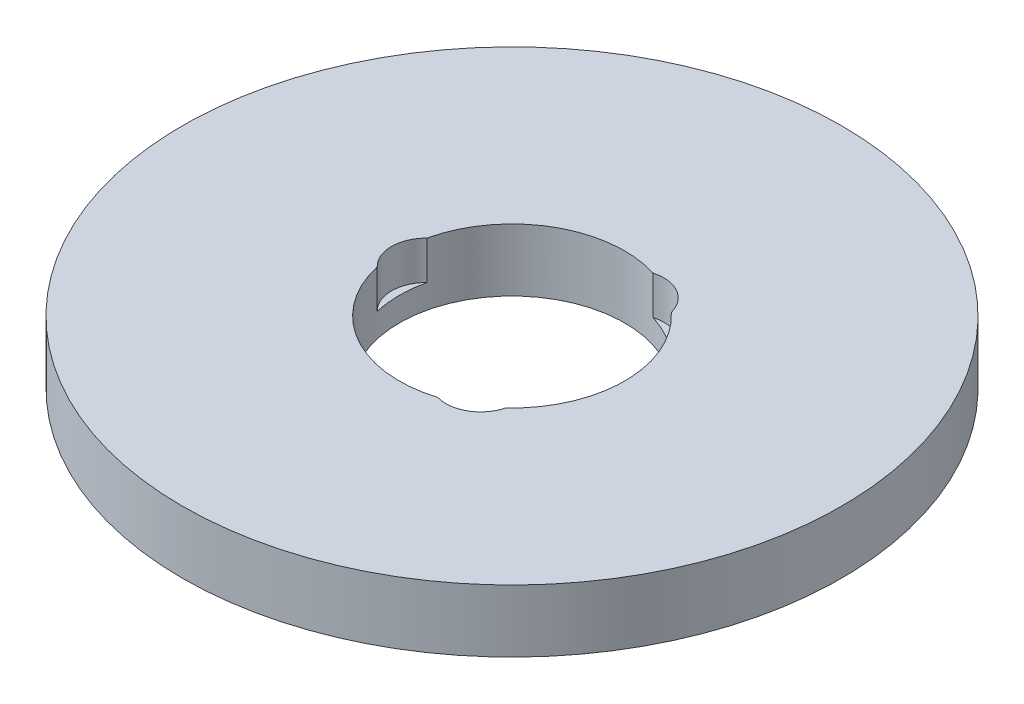
ISO-10303-21;
HEADER;
FILE_DESCRIPTION(('STEP AP214'),'2;1');
FILE_NAME('part.step','',(''),(''),'','','');
FILE_SCHEMA(('AUTOMOTIVE_DESIGN { 1 0 10303 214 1 1 1 1 }'));
ENDSEC;
DATA;
#1=APPLICATION_CONTEXT('core data for automotive mechanical design processes');
#2=APPLICATION_PROTOCOL_DEFINITION('international standard','automotive_design',2000,#1);
#3=PRODUCT_CONTEXT('',#1,'mechanical');
#4=PRODUCT('Part','Part','',(#3));
#5=PRODUCT_RELATED_PRODUCT_CATEGORY('part','',(#4));
#6=PRODUCT_DEFINITION_FORMATION('','',#4);
#7=PRODUCT_DEFINITION_CONTEXT('part definition',#1,'design');
#8=PRODUCT_DEFINITION('design','',#6,#7);
#9=PRODUCT_DEFINITION_SHAPE('','',#8);
#10=(LENGTH_UNIT() NAMED_UNIT(*) SI_UNIT(.MILLI.,.METRE.));
#11=(NAMED_UNIT(*) PLANE_ANGLE_UNIT() SI_UNIT($,.RADIAN.));
#12=(NAMED_UNIT(*) SI_UNIT($,.STERADIAN.) SOLID_ANGLE_UNIT());
#13=UNCERTAINTY_MEASURE_WITH_UNIT(LENGTH_MEASURE(1.E-05),#10,'distance_accuracy_value','');
#14=(GEOMETRIC_REPRESENTATION_CONTEXT(3) GLOBAL_UNCERTAINTY_ASSIGNED_CONTEXT((#13)) GLOBAL_UNIT_ASSIGNED_CONTEXT((#10,
#11,#12)) REPRESENTATION_CONTEXT('',''));
#15=CARTESIAN_POINT('',(0.,0.,0.));
#16=DIRECTION('',(0.,0.,1.));
#17=DIRECTION('',(1.,0.,0.));
#18=AXIS2_PLACEMENT_3D('',#15,#16,#17);
#19=CARTESIAN_POINT('',(0.,18.,0.));
#20=DIRECTION('',(0.,-1.,0.));
#21=DIRECTION('',(0.,0.,-1.));
#22=AXIS2_PLACEMENT_3D('',#19,#20,#21);
#23=CYLINDRICAL_SURFACE('',#22,95.);
#24=CARTESIAN_POINT('',(0.,18.,0.));
#25=DIRECTION('',(0.,1.,0.));
#26=DIRECTION('',(0.,0.,1.));
#27=AXIS2_PLACEMENT_3D('',#24,#25,#26);
#28=CIRCLE('',#27,95.);
#29=CARTESIAN_POINT('',(0.,18.,95.));
#30=VERTEX_POINT('',#29);
#31=EDGE_CURVE('E130',#30,#30,#28,.T.);
#32=ORIENTED_EDGE('',*,*,#31,.F.);
#33=EDGE_LOOP('',(#32));
#34=FACE_BOUND('',#33,.T.);
#35=CARTESIAN_POINT('',(0.,0.,0.));
#36=DIRECTION('',(0.,1.,0.));
#37=DIRECTION('',(0.,0.,1.));
#38=AXIS2_PLACEMENT_3D('',#35,#36,#37);
#39=CIRCLE('',#38,95.);
#40=CARTESIAN_POINT('',(0.,0.,95.));
#41=VERTEX_POINT('',#40);
#42=EDGE_CURVE('E117',#41,#41,#39,.T.);
#43=ORIENTED_EDGE('',*,*,#42,.T.);
#44=EDGE_LOOP('',(#43));
#45=FACE_BOUND('',#44,.T.);
#46=ADVANCED_FACE('F39',(#34,#45),#23,.T.);
#47=CARTESIAN_POINT('',(0.,18.,0.));
#48=DIRECTION('',(0.,1.,0.));
#49=DIRECTION('',(0.,0.,1.));
#50=AXIS2_PLACEMENT_3D('',#47,#48,#49);
#51=PLANE('',#50);
#52=CARTESIAN_POINT('',(12.3629652140103,18.,21.4132838828722));
#53=DIRECTION('',(0.,1.,0.));
#54=DIRECTION('',(0.866025403784436,0.,-0.500000000000004));
#55=AXIS2_PLACEMENT_3D('',#52,#53,#54);
#56=CIRCLE('',#55,10.);
#57=CARTESIAN_POINT('',(9.64334562870771,18.,31.0363639153378));
#58=VERTEX_POINT('',#57);
#59=CARTESIAN_POINT('',(22.0566067774276,18.,23.8695642496032));
#60=VERTEX_POINT('',#59);
#61=EDGE_CURVE('E148',#58,#60,#56,.T.);
#62=ORIENTED_EDGE('',*,*,#61,.F.);
#63=CARTESIAN_POINT('',(0.,18.,0.));
#64=DIRECTION('',(0.,1.,0.));
#65=DIRECTION('',(0.,0.,1.));
#66=AXIS2_PLACEMENT_3D('',#63,#64,#65);
#67=CIRCLE('',#66,32.5);
#68=CARTESIAN_POINT('',(-31.699952406135,18.,7.16679966573456));
#69=VERTEX_POINT('',#68);
#70=EDGE_CURVE('E113',#69,#58,#67,.T.);
#71=ORIENTED_EDGE('',*,*,#70,.F.);
#72=CARTESIAN_POINT('',(-24.7259304280203,18.,0.));
#73=DIRECTION('',(0.,1.,0.));
#74=DIRECTION('',(0.,0.,1.));
#75=AXIS2_PLACEMENT_3D('',#72,#73,#74);
#76=CIRCLE('',#75,10.);
#77=CARTESIAN_POINT('',(-31.699952406135,18.,-7.16679966573456));
#78=VERTEX_POINT('',#77);
#79=EDGE_CURVE('E125',#78,#69,#76,.T.);
#80=ORIENTED_EDGE('',*,*,#79,.F.);
#81=CARTESIAN_POINT('',(9.64334562870728,18.,-31.036363915338));
#82=VERTEX_POINT('',#81);
#83=EDGE_CURVE('E107',#82,#78,#67,.T.);
#84=ORIENTED_EDGE('',*,*,#83,.F.);
#85=CARTESIAN_POINT('',(12.36296521401,18.,-21.4132838828724));
#86=DIRECTION('',(0.,1.,0.));
#87=DIRECTION('',(-0.866025403784443,0.,-0.499999999999992));
#88=AXIS2_PLACEMENT_3D('',#85,#86,#87);
#89=CIRCLE('',#88,10.);
#90=CARTESIAN_POINT('',(22.0566067774273,18.,-23.8695642496035));
#91=VERTEX_POINT('',#90);
#92=EDGE_CURVE('E95',#91,#82,#89,.T.);
#93=ORIENTED_EDGE('',*,*,#92,.F.);
#94=EDGE_CURVE('E106',#60,#91,#67,.T.);
#95=ORIENTED_EDGE('',*,*,#94,.F.);
#96=EDGE_LOOP('',(#62,#71,#80,#84,#93,#95));
#97=FACE_BOUND('',#96,.T.);
#98=ORIENTED_EDGE('',*,*,#31,.T.);
#99=EDGE_LOOP('',(#98));
#100=FACE_BOUND('',#99,.T.);
#101=ADVANCED_FACE('F102',(#97,#100),#51,.T.);
#102=CARTESIAN_POINT('',(0.,0.,0.));
#103=DIRECTION('',(0.,1.,0.));
#104=DIRECTION('',(0.,0.,1.));
#105=AXIS2_PLACEMENT_3D('',#102,#103,#104);
#106=PLANE('',#105);
#107=CARTESIAN_POINT('',(0.,0.,0.));
#108=DIRECTION('',(0.,1.,0.));
#109=DIRECTION('',(0.,0.,1.));
#110=AXIS2_PLACEMENT_3D('',#107,#108,#109);
#111=CIRCLE('',#110,32.5);
#112=CARTESIAN_POINT('',(0.,0.,32.5));
#113=VERTEX_POINT('',#112);
#114=EDGE_CURVE('E118',#113,#113,#111,.T.);
#115=ORIENTED_EDGE('',*,*,#114,.T.);
#116=EDGE_LOOP('',(#115));
#117=FACE_BOUND('',#116,.T.);
#118=ORIENTED_EDGE('',*,*,#42,.F.);
#119=EDGE_LOOP('',(#118));
#120=FACE_BOUND('',#119,.T.);
#121=ADVANCED_FACE('F161',(#117,#120),#106,.F.);
#122=CARTESIAN_POINT('',(0.,18.,0.));
#123=DIRECTION('',(0.,-1.,0.));
#124=DIRECTION('',(0.,0.,-1.));
#125=AXIS2_PLACEMENT_3D('',#122,#123,#124);
#126=CYLINDRICAL_SURFACE('',#125,32.5);
#127=DIRECTION('',(0.,1.,0.));
#128=VECTOR('',#127,1.);
#129=CARTESIAN_POINT('',(9.64334562870771,12.4525637605796,31.0363639153378));
#130=LINE('',#129,#128);
#131=CARTESIAN_POINT('',(9.64334562870771,6.90512752115929,31.0363639153378));
#132=VERTEX_POINT('',#131);
#133=EDGE_CURVE('E11',#132,#58,#130,.T.);
#134=ORIENTED_EDGE('',*,*,#133,.F.);
#135=CARTESIAN_POINT('',(0.,6.90512752115929,0.));
#136=DIRECTION('',(0.,1.,0.));
#137=DIRECTION('',(0.,0.,1.));
#138=AXIS2_PLACEMENT_3D('',#135,#136,#137);
#139=CIRCLE('',#138,32.5);
#140=CARTESIAN_POINT('',(22.0566067774276,6.90512752115929,23.8695642496032));
#141=VERTEX_POINT('',#140);
#142=EDGE_CURVE('E100',#132,#141,#139,.T.);
#143=ORIENTED_EDGE('',*,*,#142,.T.);
#144=DIRECTION('',(0.,1.,0.));
#145=VECTOR('',#144,1.);
#146=CARTESIAN_POINT('',(22.0566067774276,12.4525637605796,23.8695642496032));
#147=LINE('',#146,#145);
#148=EDGE_CURVE('E46',#60,#141,#147,.F.);
#149=ORIENTED_EDGE('',*,*,#148,.F.);
#150=ORIENTED_EDGE('',*,*,#94,.T.);
#151=DIRECTION('',(0.,1.,0.));
#152=VECTOR('',#151,1.);
#153=CARTESIAN_POINT('',(22.0566067774273,12.4525637605796,-23.8695642496035));
#154=LINE('',#153,#152);
#155=CARTESIAN_POINT('',(22.0566067774273,6.90512752115929,-23.8695642496035));
#156=VERTEX_POINT('',#155);
#157=EDGE_CURVE('E90',#156,#91,#154,.T.);
#158=ORIENTED_EDGE('',*,*,#157,.F.);
#159=CARTESIAN_POINT('',(0.,6.90512752115929,0.));
#160=DIRECTION('',(0.,1.,0.));
#161=DIRECTION('',(0.,0.,1.));
#162=AXIS2_PLACEMENT_3D('',#159,#160,#161);
#163=CIRCLE('',#162,32.5);
#164=CARTESIAN_POINT('',(9.64334562870728,6.90512752115929,-31.036363915338));
#165=VERTEX_POINT('',#164);
#166=EDGE_CURVE('E143',#156,#165,#163,.T.);
#167=ORIENTED_EDGE('',*,*,#166,.T.);
#168=DIRECTION('',(0.,1.,0.));
#169=VECTOR('',#168,1.);
#170=CARTESIAN_POINT('',(9.64334562870727,12.4525637605796,-31.036363915338));
#171=LINE('',#170,#169);
#172=EDGE_CURVE('E98',#82,#165,#171,.F.);
#173=ORIENTED_EDGE('',*,*,#172,.F.);
#174=ORIENTED_EDGE('',*,*,#83,.T.);
#175=DIRECTION('',(0.,1.,0.));
#176=VECTOR('',#175,1.);
#177=CARTESIAN_POINT('',(-31.699952406135,12.4525637605796,-7.16679966573456));
#178=LINE('',#177,#176);
#179=CARTESIAN_POINT('',(-31.699952406135,6.90512752115929,-7.16679966573456));
#180=VERTEX_POINT('',#179);
#181=EDGE_CURVE('E137',#180,#78,#178,.T.);
#182=ORIENTED_EDGE('',*,*,#181,.F.);
#183=CARTESIAN_POINT('',(0.,6.90512752115929,0.));
#184=DIRECTION('',(0.,1.,0.));
#185=DIRECTION('',(0.,0.,1.));
#186=AXIS2_PLACEMENT_3D('',#183,#184,#185);
#187=CIRCLE('',#186,32.5);
#188=CARTESIAN_POINT('',(-31.699952406135,6.90512752115929,7.16679966573456));
#189=VERTEX_POINT('',#188);
#190=EDGE_CURVE('E128',#180,#189,#187,.T.);
#191=ORIENTED_EDGE('',*,*,#190,.T.);
#192=DIRECTION('',(0.,1.,0.));
#193=VECTOR('',#192,1.);
#194=CARTESIAN_POINT('',(-31.699952406135,12.4525637605796,7.16679966573456));
#195=LINE('',#194,#193);
#196=EDGE_CURVE('E134',#69,#189,#195,.F.);
#197=ORIENTED_EDGE('',*,*,#196,.F.);
#198=ORIENTED_EDGE('',*,*,#70,.T.);
#199=EDGE_LOOP('',(#134,#143,#149,#150,#158,#167,#173,#174,#182,#191,#197,#198));
#200=FACE_BOUND('',#199,.T.);
#201=ORIENTED_EDGE('',*,*,#114,.F.);
#202=EDGE_LOOP('',(#201));
#203=FACE_BOUND('',#202,.T.);
#204=ADVANCED_FACE('F115',(#200,#203),#126,.F.);
#205=CARTESIAN_POINT('',(-24.7259304280203,6.90512752115929,0.));
#206=DIRECTION('',(0.,1.,0.));
#207=DIRECTION('',(0.,0.,1.));
#208=AXIS2_PLACEMENT_3D('',#205,#206,#207);
#209=CYLINDRICAL_SURFACE('',#208,10.);
#210=ORIENTED_EDGE('',*,*,#181,.T.);
#211=ORIENTED_EDGE('',*,*,#79,.T.);
#212=ORIENTED_EDGE('',*,*,#196,.T.);
#213=CARTESIAN_POINT('',(-24.7259304280203,6.90512752115929,0.));
#214=DIRECTION('',(0.,1.,0.));
#215=DIRECTION('',(0.,0.,1.));
#216=AXIS2_PLACEMENT_3D('',#213,#214,#215);
#217=CIRCLE('',#216,10.);
#218=EDGE_CURVE('E127',#180,#189,#217,.T.);
#219=ORIENTED_EDGE('',*,*,#218,.F.);
#220=EDGE_LOOP('',(#210,#211,#212,#219));
#221=FACE_BOUND('',#220,.T.);
#222=ADVANCED_FACE('F175',(#221),#209,.F.);
#223=CARTESIAN_POINT('',(-24.7259304280203,6.90512752115929,0.));
#224=DIRECTION('',(0.,1.,0.));
#225=DIRECTION('',(0.,0.,1.));
#226=AXIS2_PLACEMENT_3D('',#223,#224,#225);
#227=PLANE('',#226);
#228=ORIENTED_EDGE('',*,*,#218,.T.);
#229=ORIENTED_EDGE('',*,*,#190,.F.);
#230=EDGE_LOOP('',(#228,#229));
#231=FACE_BOUND('',#230,.T.);
#232=ADVANCED_FACE('F176',(#231),#227,.T.);
#233=CARTESIAN_POINT('',(12.36296521401,6.90512752115929,-21.4132838828724));
#234=DIRECTION('',(0.,1.,0.));
#235=DIRECTION('',(0.,0.,1.));
#236=AXIS2_PLACEMENT_3D('',#233,#234,#235);
#237=CYLINDRICAL_SURFACE('',#236,10.);
#238=ORIENTED_EDGE('',*,*,#157,.T.);
#239=ORIENTED_EDGE('',*,*,#92,.T.);
#240=ORIENTED_EDGE('',*,*,#172,.T.);
#241=CARTESIAN_POINT('',(12.36296521401,6.90512752115929,-21.4132838828724));
#242=DIRECTION('',(0.,1.,0.));
#243=DIRECTION('',(-0.866025403784443,0.,-0.499999999999992));
#244=AXIS2_PLACEMENT_3D('',#241,#242,#243);
#245=CIRCLE('',#244,10.);
#246=EDGE_CURVE('E56',#156,#165,#245,.T.);
#247=ORIENTED_EDGE('',*,*,#246,.F.);
#248=EDGE_LOOP('',(#238,#239,#240,#247));
#249=FACE_BOUND('',#248,.T.);
#250=ADVANCED_FACE('F93',(#249),#237,.F.);
#251=CARTESIAN_POINT('',(12.36296521401,6.90512752115929,-21.4132838828724));
#252=DIRECTION('',(0.,1.,0.));
#253=DIRECTION('',(-0.866025403784443,0.,-0.499999999999992));
#254=AXIS2_PLACEMENT_3D('',#251,#252,#253);
#255=PLANE('',#254);
#256=ORIENTED_EDGE('',*,*,#246,.T.);
#257=ORIENTED_EDGE('',*,*,#166,.F.);
#258=EDGE_LOOP('',(#256,#257));
#259=FACE_BOUND('',#258,.T.);
#260=ADVANCED_FACE('F153',(#259),#255,.T.);
#261=CARTESIAN_POINT('',(12.3629652140103,6.90512752115929,21.4132838828722));
#262=DIRECTION('',(0.,1.,0.));
#263=DIRECTION('',(0.,0.,1.));
#264=AXIS2_PLACEMENT_3D('',#261,#262,#263);
#265=CYLINDRICAL_SURFACE('',#264,10.);
#266=ORIENTED_EDGE('',*,*,#133,.T.);
#267=ORIENTED_EDGE('',*,*,#61,.T.);
#268=ORIENTED_EDGE('',*,*,#148,.T.);
#269=CARTESIAN_POINT('',(12.3629652140103,6.90512752115929,21.4132838828722));
#270=DIRECTION('',(0.,1.,0.));
#271=DIRECTION('',(0.866025403784436,0.,-0.500000000000004));
#272=AXIS2_PLACEMENT_3D('',#269,#270,#271);
#273=CIRCLE('',#272,10.);
#274=EDGE_CURVE('E55',#132,#141,#273,.T.);
#275=ORIENTED_EDGE('',*,*,#274,.F.);
#276=EDGE_LOOP('',(#266,#267,#268,#275));
#277=FACE_BOUND('',#276,.T.);
#278=ADVANCED_FACE('F144',(#277),#265,.F.);
#279=CARTESIAN_POINT('',(12.3629652140103,6.90512752115929,21.4132838828722));
#280=DIRECTION('',(0.,1.,0.));
#281=DIRECTION('',(0.866025403784436,0.,-0.500000000000004));
#282=AXIS2_PLACEMENT_3D('',#279,#280,#281);
#283=PLANE('',#282);
#284=ORIENTED_EDGE('',*,*,#274,.T.);
#285=ORIENTED_EDGE('',*,*,#142,.F.);
#286=EDGE_LOOP('',(#284,#285));
#287=FACE_BOUND('',#286,.T.);
#288=ADVANCED_FACE('F150',(#287),#283,.T.);
#289=CLOSED_SHELL('',(#46,#101,#121,#204,#222,#232,#250,#260,#278,#288));
#290=MANIFOLD_SOLID_BREP('B2',#289);
#291=ADVANCED_BREP_SHAPE_REPRESENTATION('',(#18,#290),#14);
#292=SHAPE_DEFINITION_REPRESENTATION(#9,#291);
ENDSEC;
END-ISO-10303-21;
